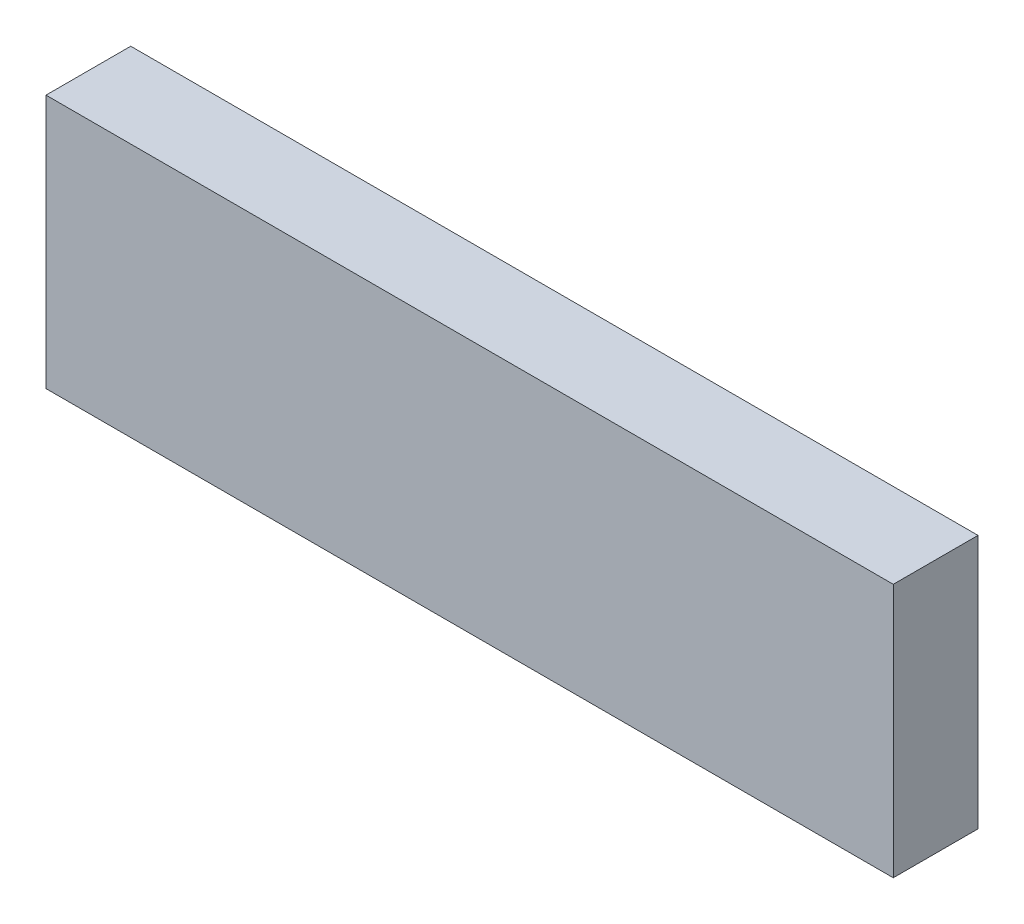
ISO-10303-21;
HEADER;
FILE_DESCRIPTION(('STEP AP214'),'2;1');
FILE_NAME('part.step','',(''),(''),'','','');
FILE_SCHEMA(('AUTOMOTIVE_DESIGN { 1 0 10303 214 1 1 1 1 }'));
ENDSEC;
DATA;
#1=APPLICATION_CONTEXT('core data for automotive mechanical design processes');
#2=APPLICATION_PROTOCOL_DEFINITION('international standard','automotive_design',2000,#1);
#3=PRODUCT_CONTEXT('',#1,'mechanical');
#4=PRODUCT('Part','Part','',(#3));
#5=PRODUCT_RELATED_PRODUCT_CATEGORY('part','',(#4));
#6=PRODUCT_DEFINITION_FORMATION('','',#4);
#7=PRODUCT_DEFINITION_CONTEXT('part definition',#1,'design');
#8=PRODUCT_DEFINITION('design','',#6,#7);
#9=PRODUCT_DEFINITION_SHAPE('','',#8);
#10=(LENGTH_UNIT() NAMED_UNIT(*) SI_UNIT(.MILLI.,.METRE.));
#11=(NAMED_UNIT(*) PLANE_ANGLE_UNIT() SI_UNIT($,.RADIAN.));
#12=(NAMED_UNIT(*) SI_UNIT($,.STERADIAN.) SOLID_ANGLE_UNIT());
#13=UNCERTAINTY_MEASURE_WITH_UNIT(LENGTH_MEASURE(1.E-05),#10,'distance_accuracy_value','');
#14=(GEOMETRIC_REPRESENTATION_CONTEXT(3) GLOBAL_UNCERTAINTY_ASSIGNED_CONTEXT((#13)) GLOBAL_UNIT_ASSIGNED_CONTEXT((#10,
#11,#12)) REPRESENTATION_CONTEXT('',''));
#15=CARTESIAN_POINT('',(0.,0.,0.));
#16=DIRECTION('',(0.,0.,1.));
#17=DIRECTION('',(1.,0.,0.));
#18=AXIS2_PLACEMENT_3D('',#15,#16,#17);
#19=CARTESIAN_POINT('',(-17.907,9.477375,6.35));
#20=DIRECTION('',(1.,0.,0.));
#21=DIRECTION('',(0.,0.,-1.));
#22=AXIS2_PLACEMENT_3D('',#19,#20,#21);
#23=PLANE('',#22);
#24=DIRECTION('',(0.,-1.,0.));
#25=VECTOR('',#24,1.);
#26=CARTESIAN_POINT('',(-17.907,9.477375,0.));
#27=LINE('',#26,#25);
#28=CARTESIAN_POINT('',(-17.907,9.477375,0.));
#29=VERTEX_POINT('',#28);
#30=CARTESIAN_POINT('',(-17.907,-9.572625,0.));
#31=VERTEX_POINT('',#30);
#32=EDGE_CURVE('E96',#29,#31,#27,.T.);
#33=ORIENTED_EDGE('',*,*,#32,.T.);
#34=DIRECTION('',(0.,0.,-1.));
#35=VECTOR('',#34,1.);
#36=CARTESIAN_POINT('',(-17.907,-9.572625,6.35));
#37=LINE('',#36,#35);
#38=CARTESIAN_POINT('',(-17.907,-9.572625,6.35));
#39=VERTEX_POINT('',#38);
#40=EDGE_CURVE('E11',#39,#31,#37,.T.);
#41=ORIENTED_EDGE('',*,*,#40,.F.);
#42=DIRECTION('',(0.,-1.,0.));
#43=VECTOR('',#42,1.);
#44=CARTESIAN_POINT('',(-17.907,9.477375,6.35));
#45=LINE('',#44,#43);
#46=CARTESIAN_POINT('',(-17.907,9.477375,6.35));
#47=VERTEX_POINT('',#46);
#48=EDGE_CURVE('E84',#47,#39,#45,.T.);
#49=ORIENTED_EDGE('',*,*,#48,.F.);
#50=DIRECTION('',(0.,0.,-1.));
#51=VECTOR('',#50,1.);
#52=CARTESIAN_POINT('',(-17.907,9.477375,6.35));
#53=LINE('',#52,#51);
#54=EDGE_CURVE('E92',#47,#29,#53,.T.);
#55=ORIENTED_EDGE('',*,*,#54,.T.);
#56=EDGE_LOOP('',(#33,#41,#49,#55));
#57=FACE_BOUND('',#56,.T.);
#58=ADVANCED_FACE('F33',(#57),#23,.F.);
#59=CARTESIAN_POINT('',(-17.907,-9.572625,6.35));
#60=DIRECTION('',(0.,1.,0.));
#61=DIRECTION('',(-1.,0.,0.));
#62=AXIS2_PLACEMENT_3D('',#59,#60,#61);
#63=PLANE('',#62);
#64=DIRECTION('',(1.,0.,0.));
#65=VECTOR('',#64,1.);
#66=CARTESIAN_POINT('',(-17.907,-9.572625,0.));
#67=LINE('',#66,#65);
#68=CARTESIAN_POINT('',(45.593,-9.572625,0.));
#69=VERTEX_POINT('',#68);
#70=EDGE_CURVE('E88',#31,#69,#67,.T.);
#71=ORIENTED_EDGE('',*,*,#70,.T.);
#72=DIRECTION('',(0.,0.,-1.));
#73=VECTOR('',#72,1.);
#74=CARTESIAN_POINT('',(45.593,-9.572625,6.35));
#75=LINE('',#74,#73);
#76=CARTESIAN_POINT('',(45.593,-9.572625,6.35));
#77=VERTEX_POINT('',#76);
#78=EDGE_CURVE('E41',#77,#69,#75,.T.);
#79=ORIENTED_EDGE('',*,*,#78,.F.);
#80=DIRECTION('',(1.,0.,0.));
#81=VECTOR('',#80,1.);
#82=CARTESIAN_POINT('',(-17.907,-9.572625,6.35));
#83=LINE('',#82,#81);
#84=EDGE_CURVE('E79',#39,#77,#83,.T.);
#85=ORIENTED_EDGE('',*,*,#84,.F.);
#86=ORIENTED_EDGE('',*,*,#40,.T.);
#87=EDGE_LOOP('',(#71,#79,#85,#86));
#88=FACE_BOUND('',#87,.T.);
#89=ADVANCED_FACE('F87',(#88),#63,.F.);
#90=CARTESIAN_POINT('',(45.593,9.477375,6.35));
#91=DIRECTION('',(-1.,0.,0.));
#92=DIRECTION('',(0.,0.,1.));
#93=AXIS2_PLACEMENT_3D('',#90,#91,#92);
#94=PLANE('',#93);
#95=DIRECTION('',(0.,1.,0.));
#96=VECTOR('',#95,1.);
#97=CARTESIAN_POINT('',(45.593,9.477375,0.));
#98=LINE('',#97,#96);
#99=CARTESIAN_POINT('',(45.593,9.477375,0.));
#100=VERTEX_POINT('',#99);
#101=EDGE_CURVE('E66',#69,#100,#98,.T.);
#102=ORIENTED_EDGE('',*,*,#101,.T.);
#103=DIRECTION('',(0.,0.,-1.));
#104=VECTOR('',#103,1.);
#105=CARTESIAN_POINT('',(45.593,9.477375,6.35));
#106=LINE('',#105,#104);
#107=CARTESIAN_POINT('',(45.593,9.477375,6.35));
#108=VERTEX_POINT('',#107);
#109=EDGE_CURVE('E89',#108,#100,#106,.T.);
#110=ORIENTED_EDGE('',*,*,#109,.F.);
#111=DIRECTION('',(0.,1.,0.));
#112=VECTOR('',#111,1.);
#113=CARTESIAN_POINT('',(45.593,9.477375,6.35));
#114=LINE('',#113,#112);
#115=EDGE_CURVE('E82',#77,#108,#114,.T.);
#116=ORIENTED_EDGE('',*,*,#115,.F.);
#117=ORIENTED_EDGE('',*,*,#78,.T.);
#118=EDGE_LOOP('',(#102,#110,#116,#117));
#119=FACE_BOUND('',#118,.T.);
#120=ADVANCED_FACE('F90',(#119),#94,.F.);
#121=CARTESIAN_POINT('',(-17.907,9.477375,6.35));
#122=DIRECTION('',(0.,-1.,0.));
#123=DIRECTION('',(0.,0.,-1.));
#124=AXIS2_PLACEMENT_3D('',#121,#122,#123);
#125=PLANE('',#124);
#126=DIRECTION('',(-1.,0.,0.));
#127=VECTOR('',#126,1.);
#128=CARTESIAN_POINT('',(-17.907,9.477375,0.));
#129=LINE('',#128,#127);
#130=EDGE_CURVE('E72',#100,#29,#129,.T.);
#131=ORIENTED_EDGE('',*,*,#130,.T.);
#132=ORIENTED_EDGE('',*,*,#54,.F.);
#133=DIRECTION('',(-1.,0.,0.));
#134=VECTOR('',#133,1.);
#135=CARTESIAN_POINT('',(-17.907,9.477375,6.35));
#136=LINE('',#135,#134);
#137=EDGE_CURVE('E49',#108,#47,#136,.T.);
#138=ORIENTED_EDGE('',*,*,#137,.F.);
#139=ORIENTED_EDGE('',*,*,#109,.T.);
#140=EDGE_LOOP('',(#131,#132,#138,#139));
#141=FACE_BOUND('',#140,.T.);
#142=ADVANCED_FACE('F103',(#141),#125,.F.);
#143=CARTESIAN_POINT('',(0.,0.,6.35));
#144=DIRECTION('',(0.,0.,1.));
#145=DIRECTION('',(1.,0.,0.));
#146=AXIS2_PLACEMENT_3D('',#143,#144,#145);
#147=PLANE('',#146);
#148=ORIENTED_EDGE('',*,*,#48,.T.);
#149=ORIENTED_EDGE('',*,*,#84,.T.);
#150=ORIENTED_EDGE('',*,*,#115,.T.);
#151=ORIENTED_EDGE('',*,*,#137,.T.);
#152=EDGE_LOOP('',(#148,#149,#150,#151));
#153=FACE_BOUND('',#152,.T.);
#154=ADVANCED_FACE('F80',(#153),#147,.T.);
#155=CARTESIAN_POINT('',(0.,0.,0.));
#156=DIRECTION('',(0.,0.,1.));
#157=DIRECTION('',(1.,0.,0.));
#158=AXIS2_PLACEMENT_3D('',#155,#156,#157);
#159=PLANE('',#158);
#160=ORIENTED_EDGE('',*,*,#32,.F.);
#161=ORIENTED_EDGE('',*,*,#130,.F.);
#162=ORIENTED_EDGE('',*,*,#101,.F.);
#163=ORIENTED_EDGE('',*,*,#70,.F.);
#164=EDGE_LOOP('',(#160,#161,#162,#163));
#165=FACE_BOUND('',#164,.T.);
#166=ADVANCED_FACE('F106',(#165),#159,.F.);
#167=CLOSED_SHELL('',(#58,#89,#120,#142,#154,#166));
#168=MANIFOLD_SOLID_BREP('B2',#167);
#169=ADVANCED_BREP_SHAPE_REPRESENTATION('',(#18,#168),#14);
#170=SHAPE_DEFINITION_REPRESENTATION(#9,#169);
ENDSEC;
END-ISO-10303-21;
